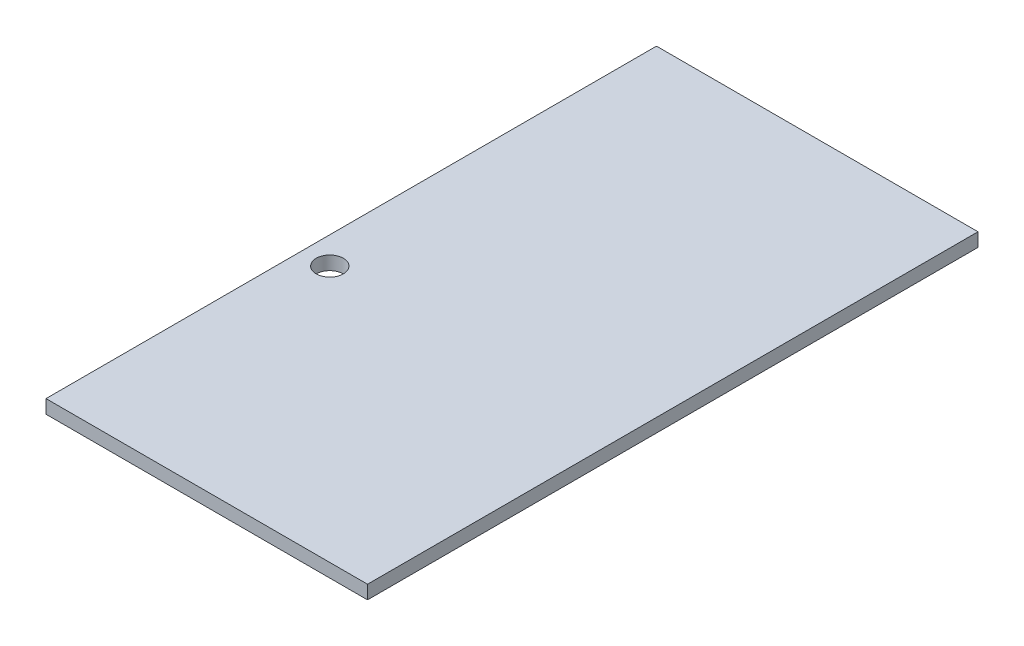
ISO-10303-21;
HEADER;
FILE_DESCRIPTION(('STEP AP214'),'2;1');
FILE_NAME('part.step','',(''),(''),'','','');
FILE_SCHEMA(('AUTOMOTIVE_DESIGN { 1 0 10303 214 1 1 1 1 }'));
ENDSEC;
DATA;
#1=APPLICATION_CONTEXT('core data for automotive mechanical design processes');
#2=APPLICATION_PROTOCOL_DEFINITION('international standard','automotive_design',2000,#1);
#3=PRODUCT_CONTEXT('',#1,'mechanical');
#4=PRODUCT('Part','Part','',(#3));
#5=PRODUCT_RELATED_PRODUCT_CATEGORY('part','',(#4));
#6=PRODUCT_DEFINITION_FORMATION('','',#4);
#7=PRODUCT_DEFINITION_CONTEXT('part definition',#1,'design');
#8=PRODUCT_DEFINITION('design','',#6,#7);
#9=PRODUCT_DEFINITION_SHAPE('','',#8);
#10=(LENGTH_UNIT() NAMED_UNIT(*) SI_UNIT(.MILLI.,.METRE.));
#11=(NAMED_UNIT(*) PLANE_ANGLE_UNIT() SI_UNIT($,.RADIAN.));
#12=(NAMED_UNIT(*) SI_UNIT($,.STERADIAN.) SOLID_ANGLE_UNIT());
#13=UNCERTAINTY_MEASURE_WITH_UNIT(LENGTH_MEASURE(1.E-05),#10,'distance_accuracy_value','');
#14=(GEOMETRIC_REPRESENTATION_CONTEXT(3) GLOBAL_UNCERTAINTY_ASSIGNED_CONTEXT((#13)) GLOBAL_UNIT_ASSIGNED_CONTEXT((#10,
#11,#12)) REPRESENTATION_CONTEXT('',''));
#15=CARTESIAN_POINT('',(0.,0.,0.));
#16=DIRECTION('',(0.,0.,1.));
#17=DIRECTION('',(1.,0.,0.));
#18=AXIS2_PLACEMENT_3D('',#15,#16,#17);
#19=CARTESIAN_POINT('',(-118.5,10.,225.));
#20=DIRECTION('',(1.,0.,0.));
#21=DIRECTION('',(0.,0.,-1.));
#22=AXIS2_PLACEMENT_3D('',#19,#20,#21);
#23=PLANE('',#22);
#24=DIRECTION('',(0.,-1.,0.));
#25=VECTOR('',#24,1.);
#26=CARTESIAN_POINT('',(-118.5,10.,-225.));
#27=LINE('',#26,#25);
#28=CARTESIAN_POINT('',(-118.5,10.,-225.));
#29=VERTEX_POINT('',#28);
#30=CARTESIAN_POINT('',(-118.5,0.,-225.));
#31=VERTEX_POINT('',#30);
#32=EDGE_CURVE('E92',#29,#31,#27,.T.);
#33=ORIENTED_EDGE('',*,*,#32,.T.);
#34=DIRECTION('',(0.,0.,1.));
#35=VECTOR('',#34,1.);
#36=CARTESIAN_POINT('',(-118.5,0.,225.));
#37=LINE('',#36,#35);
#38=CARTESIAN_POINT('',(-118.5,0.,225.));
#39=VERTEX_POINT('',#38);
#40=EDGE_CURVE('E98',#31,#39,#37,.T.);
#41=ORIENTED_EDGE('',*,*,#40,.T.);
#42=DIRECTION('',(0.,-1.,0.));
#43=VECTOR('',#42,1.);
#44=CARTESIAN_POINT('',(-118.5,10.,225.));
#45=LINE('',#44,#43);
#46=CARTESIAN_POINT('',(-118.5,10.,225.));
#47=VERTEX_POINT('',#46);
#48=EDGE_CURVE('E11',#47,#39,#45,.T.);
#49=ORIENTED_EDGE('',*,*,#48,.F.);
#50=DIRECTION('',(0.,0.,1.));
#51=VECTOR('',#50,1.);
#52=CARTESIAN_POINT('',(-118.5,10.,225.));
#53=LINE('',#52,#51);
#54=EDGE_CURVE('E83',#29,#47,#53,.T.);
#55=ORIENTED_EDGE('',*,*,#54,.F.);
#56=EDGE_LOOP('',(#33,#41,#49,#55));
#57=FACE_BOUND('',#56,.T.);
#58=ADVANCED_FACE('F35',(#57),#23,.F.);
#59=CARTESIAN_POINT('',(-118.5,10.,225.));
#60=DIRECTION('',(0.,0.,-1.));
#61=DIRECTION('',(-1.,0.,0.));
#62=AXIS2_PLACEMENT_3D('',#59,#60,#61);
#63=PLANE('',#62);
#64=ORIENTED_EDGE('',*,*,#48,.T.);
#65=DIRECTION('',(1.,0.,0.));
#66=VECTOR('',#65,1.);
#67=CARTESIAN_POINT('',(-118.5,0.,225.));
#68=LINE('',#67,#66);
#69=CARTESIAN_POINT('',(118.5,0.,225.));
#70=VERTEX_POINT('',#69);
#71=EDGE_CURVE('E62',#39,#70,#68,.T.);
#72=ORIENTED_EDGE('',*,*,#71,.T.);
#73=DIRECTION('',(0.,-1.,0.));
#74=VECTOR('',#73,1.);
#75=CARTESIAN_POINT('',(118.5,10.,225.));
#76=LINE('',#75,#74);
#77=CARTESIAN_POINT('',(118.5,10.,225.));
#78=VERTEX_POINT('',#77);
#79=EDGE_CURVE('E43',#78,#70,#76,.T.);
#80=ORIENTED_EDGE('',*,*,#79,.F.);
#81=DIRECTION('',(1.,0.,0.));
#82=VECTOR('',#81,1.);
#83=CARTESIAN_POINT('',(-118.5,10.,225.));
#84=LINE('',#83,#82);
#85=EDGE_CURVE('E77',#47,#78,#84,.T.);
#86=ORIENTED_EDGE('',*,*,#85,.F.);
#87=EDGE_LOOP('',(#64,#72,#80,#86));
#88=FACE_BOUND('',#87,.T.);
#89=ADVANCED_FACE('F86',(#88),#63,.F.);
#90=CARTESIAN_POINT('',(118.5,10.,225.));
#91=DIRECTION('',(-1.,0.,0.));
#92=DIRECTION('',(0.,0.,1.));
#93=AXIS2_PLACEMENT_3D('',#90,#91,#92);
#94=PLANE('',#93);
#95=DIRECTION('',(0.,0.,-1.));
#96=VECTOR('',#95,1.);
#97=CARTESIAN_POINT('',(118.5,0.,225.));
#98=LINE('',#97,#96);
#99=CARTESIAN_POINT('',(118.5,0.,-225.));
#100=VERTEX_POINT('',#99);
#101=EDGE_CURVE('E97',#70,#100,#98,.T.);
#102=ORIENTED_EDGE('',*,*,#101,.T.);
#103=DIRECTION('',(0.,-1.,0.));
#104=VECTOR('',#103,1.);
#105=CARTESIAN_POINT('',(118.5,10.,-225.));
#106=LINE('',#105,#104);
#107=CARTESIAN_POINT('',(118.5,10.,-225.));
#108=VERTEX_POINT('',#107);
#109=EDGE_CURVE('E88',#108,#100,#106,.T.);
#110=ORIENTED_EDGE('',*,*,#109,.F.);
#111=DIRECTION('',(0.,0.,-1.));
#112=VECTOR('',#111,1.);
#113=CARTESIAN_POINT('',(118.5,10.,225.));
#114=LINE('',#113,#112);
#115=EDGE_CURVE('E80',#78,#108,#114,.T.);
#116=ORIENTED_EDGE('',*,*,#115,.F.);
#117=ORIENTED_EDGE('',*,*,#79,.T.);
#118=EDGE_LOOP('',(#102,#110,#116,#117));
#119=FACE_BOUND('',#118,.T.);
#120=ADVANCED_FACE('F89',(#119),#94,.F.);
#121=CARTESIAN_POINT('',(-118.5,10.,-225.));
#122=DIRECTION('',(0.,0.,1.));
#123=DIRECTION('',(1.,0.,0.));
#124=AXIS2_PLACEMENT_3D('',#121,#122,#123);
#125=PLANE('',#124);
#126=DIRECTION('',(-1.,0.,0.));
#127=VECTOR('',#126,1.);
#128=CARTESIAN_POINT('',(-118.5,0.,-225.));
#129=LINE('',#128,#127);
#130=EDGE_CURVE('E100',#100,#31,#129,.T.);
#131=ORIENTED_EDGE('',*,*,#130,.T.);
#132=ORIENTED_EDGE('',*,*,#32,.F.);
#133=DIRECTION('',(-1.,0.,0.));
#134=VECTOR('',#133,1.);
#135=CARTESIAN_POINT('',(-118.5,10.,-225.));
#136=LINE('',#135,#134);
#137=EDGE_CURVE('E51',#108,#29,#136,.T.);
#138=ORIENTED_EDGE('',*,*,#137,.F.);
#139=ORIENTED_EDGE('',*,*,#109,.T.);
#140=EDGE_LOOP('',(#131,#132,#138,#139));
#141=FACE_BOUND('',#140,.T.);
#142=ADVANCED_FACE('F106',(#141),#125,.F.);
#143=CARTESIAN_POINT('',(0.,10.,0.));
#144=DIRECTION('',(0.,-1.,0.));
#145=DIRECTION('',(0.,0.,-1.));
#146=AXIS2_PLACEMENT_3D('',#143,#144,#145);
#147=PLANE('',#146);
#148=CARTESIAN_POINT('',(-98.5,10.,35.8));
#149=DIRECTION('',(0.,-1.,0.));
#150=DIRECTION('',(0.,0.,-1.));
#151=AXIS2_PLACEMENT_3D('',#148,#149,#150);
#152=CIRCLE('',#151,9.99999999999999);
#153=CARTESIAN_POINT('',(-98.5,10.,25.8));
#154=VERTEX_POINT('',#153);
#155=EDGE_CURVE('E109',#154,#154,#152,.T.);
#156=ORIENTED_EDGE('',*,*,#155,.T.);
#157=EDGE_LOOP('',(#156));
#158=FACE_BOUND('',#157,.T.);
#159=ORIENTED_EDGE('',*,*,#54,.T.);
#160=ORIENTED_EDGE('',*,*,#85,.T.);
#161=ORIENTED_EDGE('',*,*,#115,.T.);
#162=ORIENTED_EDGE('',*,*,#137,.T.);
#163=EDGE_LOOP('',(#159,#160,#161,#162));
#164=FACE_BOUND('',#163,.T.);
#165=ADVANCED_FACE('F78',(#158,#164),#147,.F.);
#166=CARTESIAN_POINT('',(0.,0.,0.));
#167=DIRECTION('',(0.,-1.,0.));
#168=DIRECTION('',(0.,0.,-1.));
#169=AXIS2_PLACEMENT_3D('',#166,#167,#168);
#170=PLANE('',#169);
#171=CARTESIAN_POINT('',(-98.5,0.,35.8));
#172=DIRECTION('',(0.,-1.,0.));
#173=DIRECTION('',(0.,0.,-1.));
#174=AXIS2_PLACEMENT_3D('',#171,#172,#173);
#175=CIRCLE('',#174,9.99999999999999);
#176=CARTESIAN_POINT('',(-98.5,0.,25.8));
#177=VERTEX_POINT('',#176);
#178=EDGE_CURVE('E112',#177,#177,#175,.T.);
#179=ORIENTED_EDGE('',*,*,#178,.F.);
#180=EDGE_LOOP('',(#179));
#181=FACE_BOUND('',#180,.T.);
#182=ORIENTED_EDGE('',*,*,#71,.F.);
#183=ORIENTED_EDGE('',*,*,#40,.F.);
#184=ORIENTED_EDGE('',*,*,#130,.F.);
#185=ORIENTED_EDGE('',*,*,#101,.F.);
#186=EDGE_LOOP('',(#182,#183,#184,#185));
#187=FACE_BOUND('',#186,.T.);
#188=ADVANCED_FACE('F107',(#181,#187),#170,.T.);
#189=CARTESIAN_POINT('',(-98.5,10.,35.8));
#190=DIRECTION('',(0.,-1.,0.));
#191=DIRECTION('',(0.,0.,-1.));
#192=AXIS2_PLACEMENT_3D('',#189,#190,#191);
#193=CYLINDRICAL_SURFACE('',#192,9.99999999999999);
#194=ORIENTED_EDGE('',*,*,#155,.F.);
#195=EDGE_LOOP('',(#194));
#196=FACE_BOUND('',#195,.T.);
#197=ORIENTED_EDGE('',*,*,#178,.T.);
#198=EDGE_LOOP('',(#197));
#199=FACE_BOUND('',#198,.T.);
#200=ADVANCED_FACE('F119',(#196,#199),#193,.F.);
#201=CLOSED_SHELL('',(#58,#89,#120,#142,#165,#188,#200));
#202=MANIFOLD_SOLID_BREP('B2',#201);
#203=ADVANCED_BREP_SHAPE_REPRESENTATION('',(#18,#202),#14);
#204=SHAPE_DEFINITION_REPRESENTATION(#9,#203);
ENDSEC;
END-ISO-10303-21;
